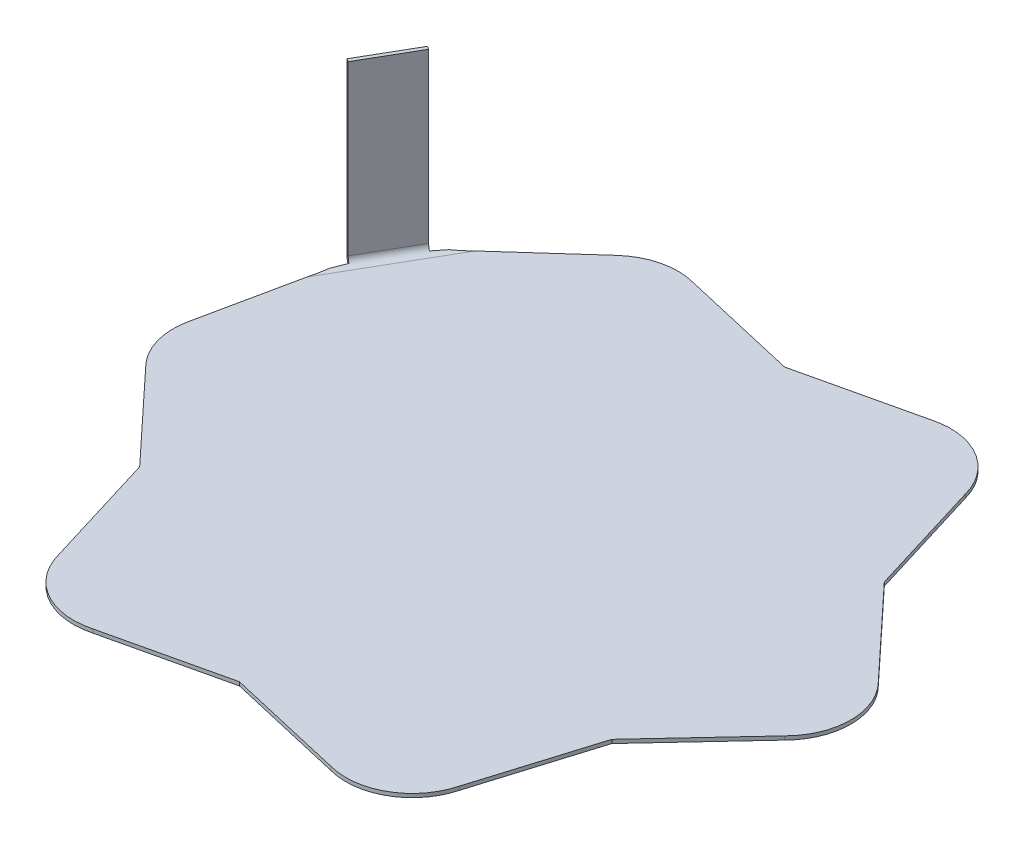
ISO-10303-21;
HEADER;
FILE_DESCRIPTION(('STEP AP214'),'2;1');
FILE_NAME('part.step','',(''),(''),'','','');
FILE_SCHEMA(('AUTOMOTIVE_DESIGN { 1 0 10303 214 1 1 1 1 }'));
ENDSEC;
DATA;
#1=APPLICATION_CONTEXT('core data for automotive mechanical design processes');
#2=APPLICATION_PROTOCOL_DEFINITION('international standard','automotive_design',2000,#1);
#3=PRODUCT_CONTEXT('',#1,'mechanical');
#4=PRODUCT('Part','Part','',(#3));
#5=PRODUCT_RELATED_PRODUCT_CATEGORY('part','',(#4));
#6=PRODUCT_DEFINITION_FORMATION('','',#4);
#7=PRODUCT_DEFINITION_CONTEXT('part definition',#1,'design');
#8=PRODUCT_DEFINITION('design','',#6,#7);
#9=PRODUCT_DEFINITION_SHAPE('','',#8);
#10=(LENGTH_UNIT() NAMED_UNIT(*) SI_UNIT(.MILLI.,.METRE.));
#11=(NAMED_UNIT(*) PLANE_ANGLE_UNIT() SI_UNIT($,.RADIAN.));
#12=(NAMED_UNIT(*) SI_UNIT($,.STERADIAN.) SOLID_ANGLE_UNIT());
#13=UNCERTAINTY_MEASURE_WITH_UNIT(LENGTH_MEASURE(1.E-05),#10,'distance_accuracy_value','');
#14=(GEOMETRIC_REPRESENTATION_CONTEXT(3) GLOBAL_UNCERTAINTY_ASSIGNED_CONTEXT((#13)) GLOBAL_UNIT_ASSIGNED_CONTEXT((#10,
#11,#12)) REPRESENTATION_CONTEXT('',''));
#15=CARTESIAN_POINT('',(0.,0.,0.));
#16=DIRECTION('',(0.,0.,1.));
#17=DIRECTION('',(1.,0.,0.));
#18=AXIS2_PLACEMENT_3D('',#15,#16,#17);
#19=CARTESIAN_POINT('',(-20.0596411839306,-22.644626179026,-11.5814392373897));
#20=DIRECTION('',(0.866025403784438,0.,0.500000000000002));
#21=DIRECTION('',(-0.433012701892222,-0.500000000000002,0.749999999999997));
#22=AXIS2_PLACEMENT_3D('',#19,#20,#21);
#23=PLANE('',#22);
#24=DIRECTION('',(0.,1.,0.));
#25=VECTOR('',#24,1.);
#26=CARTESIAN_POINT('',(-19.0596411839306,-22.644626179026,-13.3134900449586));
#27=LINE('',#26,#25);
#28=CARTESIAN_POINT('',(-19.0596411839305,0.749999999999993,-13.3134900449585));
#29=VERTEX_POINT('',#28);
#30=CARTESIAN_POINT('',(-19.0596411839305,12.163487864756,-13.3134900449585));
#31=VERTEX_POINT('',#30);
#32=EDGE_CURVE('E144',#29,#31,#27,.T.);
#33=ORIENTED_EDGE('',*,*,#32,.F.);
#34=DIRECTION('',(-0.500000000000002,0.,0.866025403784438));
#35=VECTOR('',#34,1.);
#36=CARTESIAN_POINT('',(-20.0596411839305,0.750000000000011,-11.5814392373897));
#37=LINE('',#36,#35);
#38=CARTESIAN_POINT('',(-21.0596411839305,0.750000000000018,-9.84938842982074));
#39=VERTEX_POINT('',#38);
#40=EDGE_CURVE('E686',#29,#39,#37,.T.);
#41=ORIENTED_EDGE('',*,*,#40,.T.);
#42=DIRECTION('',(0.,-1.,0.));
#43=VECTOR('',#42,1.);
#44=CARTESIAN_POINT('',(-21.0596411839306,-22.644626179026,-9.84938842982081));
#45=LINE('',#44,#43);
#46=CARTESIAN_POINT('',(-21.0596411839305,12.163487864756,-9.84938842982071));
#47=VERTEX_POINT('',#46);
#48=EDGE_CURVE('E362',#47,#39,#45,.T.);
#49=ORIENTED_EDGE('',*,*,#48,.F.);
#50=DIRECTION('',(-0.500000000000002,0.,0.866025403784438));
#51=VECTOR('',#50,1.);
#52=CARTESIAN_POINT('',(-20.0596411839305,12.163487864756,-11.5814392373896));
#53=LINE('',#52,#51);
#54=EDGE_CURVE('E365',#31,#47,#53,.T.);
#55=ORIENTED_EDGE('',*,*,#54,.F.);
#56=EDGE_LOOP('',(#33,#41,#49,#55));
#57=FACE_BOUND('',#56,.T.);
#58=ADVANCED_FACE('F140',(#57),#23,.F.);
#59=CARTESIAN_POINT('',(-21.0596411839306,-22.644626179026,-9.84938842982081));
#60=DIRECTION('',(-0.500000000000002,0.,0.866025403784438));
#61=DIRECTION('',(0.,-1.,0.));
#62=AXIS2_PLACEMENT_3D('',#59,#60,#61);
#63=PLANE('',#62);
#64=DIRECTION('',(-0.866025403784438,0.,-0.500000000000002));
#65=VECTOR('',#64,1.);
#66=CARTESIAN_POINT('',(-21.0596411839305,0.750000000000018,-9.84938842982074));
#67=LINE('',#66,#65);
#68=CARTESIAN_POINT('',(-20.8431348329844,0.750000000000001,-9.72438842982075));
#69=VERTEX_POINT('',#68);
#70=EDGE_CURVE('E12',#69,#39,#67,.T.);
#71=ORIENTED_EDGE('',*,*,#70,.F.);
#72=DIRECTION('',(0.,-1.,0.));
#73=VECTOR('',#72,1.);
#74=CARTESIAN_POINT('',(-20.8431348329845,-22.644626179026,-9.72438842982081));
#75=LINE('',#74,#73);
#76=CARTESIAN_POINT('',(-20.8431348329844,12.163487864756,-9.72438842982071));
#77=VERTEX_POINT('',#76);
#78=EDGE_CURVE('E354',#77,#69,#75,.T.);
#79=ORIENTED_EDGE('',*,*,#78,.F.);
#80=DIRECTION('',(-0.866025403784438,0.,-0.500000000000002));
#81=VECTOR('',#80,1.);
#82=CARTESIAN_POINT('',(-21.0596411839305,12.163487864756,-9.84938842982071));
#83=LINE('',#82,#81);
#84=EDGE_CURVE('E178',#77,#47,#83,.T.);
#85=ORIENTED_EDGE('',*,*,#84,.T.);
#86=ORIENTED_EDGE('',*,*,#48,.T.);
#87=EDGE_LOOP('',(#71,#79,#85,#86));
#88=FACE_BOUND('',#87,.T.);
#89=ADVANCED_FACE('F142',(#88),#63,.T.);
#90=CARTESIAN_POINT('',(-20.0596411839305,12.163487864756,-11.5814392373896));
#91=DIRECTION('',(0.,1.,0.));
#92=DIRECTION('',(-0.500000000000002,0.,0.866025403784438));
#93=AXIS2_PLACEMENT_3D('',#90,#91,#92);
#94=PLANE('',#93);
#95=ORIENTED_EDGE('',*,*,#84,.F.);
#96=DIRECTION('',(-0.500000000000002,0.,0.866025403784438));
#97=VECTOR('',#96,1.);
#98=CARTESIAN_POINT('',(-19.8431348329844,12.163487864756,-11.4564392373896));
#99=LINE('',#98,#97);
#100=CARTESIAN_POINT('',(-18.8431348329844,12.163487864756,-13.1884900449585));
#101=VERTEX_POINT('',#100);
#102=EDGE_CURVE('E356',#101,#77,#99,.T.);
#103=ORIENTED_EDGE('',*,*,#102,.F.);
#104=DIRECTION('',(-0.866025403784438,0.,-0.500000000000002));
#105=VECTOR('',#104,1.);
#106=CARTESIAN_POINT('',(-19.0596411839305,12.163487864756,-13.3134900449585));
#107=LINE('',#106,#105);
#108=EDGE_CURVE('E367',#101,#31,#107,.T.);
#109=ORIENTED_EDGE('',*,*,#108,.T.);
#110=ORIENTED_EDGE('',*,*,#54,.T.);
#111=EDGE_LOOP('',(#95,#103,#109,#110));
#112=FACE_BOUND('',#111,.T.);
#113=ADVANCED_FACE('F399',(#112),#94,.T.);
#114=CARTESIAN_POINT('',(-19.0596411839306,-22.644626179026,-13.3134900449586));
#115=DIRECTION('',(0.500000000000002,0.,-0.866025403784438));
#116=DIRECTION('',(0.,1.,0.));
#117=AXIS2_PLACEMENT_3D('',#114,#115,#116);
#118=PLANE('',#117);
#119=DIRECTION('',(0.866025403784438,0.,0.500000000000002));
#120=VECTOR('',#119,1.);
#121=CARTESIAN_POINT('',(-19.0596411839305,0.750000000000004,-13.3134900449585));
#122=LINE('',#121,#120);
#123=CARTESIAN_POINT('',(-18.8431348329844,0.750000000000001,-13.1884900449585));
#124=VERTEX_POINT('',#123);
#125=EDGE_CURVE('E343',#29,#124,#122,.T.);
#126=ORIENTED_EDGE('',*,*,#125,.F.);
#127=ORIENTED_EDGE('',*,*,#32,.T.);
#128=ORIENTED_EDGE('',*,*,#108,.F.);
#129=DIRECTION('',(0.,1.,0.));
#130=VECTOR('',#129,1.);
#131=CARTESIAN_POINT('',(-18.8431348329845,-22.644626179026,-13.1884900449586));
#132=LINE('',#131,#130);
#133=EDGE_CURVE('E358',#124,#101,#132,.T.);
#134=ORIENTED_EDGE('',*,*,#133,.F.);
#135=EDGE_LOOP('',(#126,#127,#128,#134));
#136=FACE_BOUND('',#135,.T.);
#137=ADVANCED_FACE('F402',(#136),#118,.T.);
#138=CARTESIAN_POINT('',(-19.8431348329845,-22.644626179026,-11.4564392373897));
#139=DIRECTION('',(0.866025403784438,0.,0.500000000000002));
#140=DIRECTION('',(-0.433012701892222,-0.500000000000002,0.749999999999997));
#141=AXIS2_PLACEMENT_3D('',#138,#139,#140);
#142=PLANE('',#141);
#143=DIRECTION('',(-0.500000000000002,0.,0.866025403784438));
#144=VECTOR('',#143,1.);
#145=CARTESIAN_POINT('',(-19.8431348329844,0.750000000000011,-11.4564392373897));
#146=LINE('',#145,#144);
#147=EDGE_CURVE('E149',#124,#69,#146,.T.);
#148=ORIENTED_EDGE('',*,*,#147,.F.);
#149=ORIENTED_EDGE('',*,*,#133,.T.);
#150=ORIENTED_EDGE('',*,*,#102,.T.);
#151=ORIENTED_EDGE('',*,*,#78,.T.);
#152=EDGE_LOOP('',(#148,#149,#150,#151));
#153=FACE_BOUND('',#152,.T.);
#154=ADVANCED_FACE('F355',(#153),#142,.T.);
#155=CARTESIAN_POINT('',(-18.5,0.,0.));
#156=DIRECTION('',(0.,1.,0.));
#157=DIRECTION('',(0.,0.,1.));
#158=AXIS2_PLACEMENT_3D('',#155,#156,#157);
#159=CYLINDRICAL_SURFACE('',#158,4.5);
#160=DIRECTION('',(0.,-1.,0.));
#161=VECTOR('',#160,1.);
#162=CARTESIAN_POINT('',(-21.6819805153395,0.,3.18198051533948));
#163=LINE('',#162,#161);
#164=CARTESIAN_POINT('',(-21.6819805153394,0.25,3.18198051533955));
#165=VERTEX_POINT('',#164);
#166=CARTESIAN_POINT('',(-21.6819805153395,0.,3.18198051533948));
#167=VERTEX_POINT('',#166);
#168=EDGE_CURVE('E586',#165,#167,#163,.T.);
#169=ORIENTED_EDGE('',*,*,#168,.F.);
#170=CARTESIAN_POINT('',(-18.5,0.25,0.));
#171=DIRECTION('',(0.,1.,0.));
#172=DIRECTION('',(0.,0.,1.));
#173=AXIS2_PLACEMENT_3D('',#170,#171,#172);
#174=CIRCLE('',#173,4.5);
#175=CARTESIAN_POINT('',(-22.903077106198,0.25,-0.928930566229353));
#176=VERTEX_POINT('',#175);
#177=EDGE_CURVE('E671',#176,#165,#174,.T.);
#178=ORIENTED_EDGE('',*,*,#177,.F.);
#179=DIRECTION('',(0.,-1.,0.));
#180=VECTOR('',#179,1.);
#181=CARTESIAN_POINT('',(-22.903077106198,0.,-0.928930566229353));
#182=LINE('',#181,#180);
#183=CARTESIAN_POINT('',(-22.903077106198,0.,-0.928930566229353));
#184=VERTEX_POINT('',#183);
#185=EDGE_CURVE('E501',#176,#184,#182,.T.);
#186=ORIENTED_EDGE('',*,*,#185,.T.);
#187=CARTESIAN_POINT('',(-18.5,0.,0.));
#188=DIRECTION('',(0.,1.,0.));
#189=DIRECTION('',(0.,0.,1.));
#190=AXIS2_PLACEMENT_3D('',#187,#188,#189);
#191=CIRCLE('',#190,4.5);
#192=EDGE_CURVE('E591',#184,#167,#191,.T.);
#193=ORIENTED_EDGE('',*,*,#192,.T.);
#194=EDGE_LOOP('',(#169,#178,#186,#193));
#195=FACE_BOUND('',#194,.T.);
#196=ADVANCED_FACE('F407',(#195),#159,.T.);
#197=CARTESIAN_POINT('',(-13.1805779992319,0.,12.2954121928525));
#198=DIRECTION('',(0.731234028699535,0.,-0.682126670987029));
#199=DIRECTION('',(-0.682126670987029,0.,-0.731234028699535));
#200=AXIS2_PLACEMENT_3D('',#197,#198,#199);
#201=PLANE('',#200);
#202=DIRECTION('',(0.,-1.,0.));
#203=VECTOR('',#202,1.);
#204=CARTESIAN_POINT('',(-16.0214699700121,0.,9.25000000000001));
#205=LINE('',#204,#203);
#206=CARTESIAN_POINT('',(-16.0214699700121,0.25,9.25000000000001));
#207=VERTEX_POINT('',#206);
#208=CARTESIAN_POINT('',(-16.0214699700121,0.,9.25000000000001));
#209=VERTEX_POINT('',#208);
#210=EDGE_CURVE('E581',#207,#209,#205,.T.);
#211=ORIENTED_EDGE('',*,*,#210,.F.);
#212=DIRECTION('',(-0.682126670987029,0.,-0.731234028699535));
#213=VECTOR('',#212,1.);
#214=CARTESIAN_POINT('',(-13.1805779992319,0.25,12.2954121928525));
#215=LINE('',#214,#213);
#216=EDGE_CURVE('E588',#207,#165,#215,.T.);
#217=ORIENTED_EDGE('',*,*,#216,.T.);
#218=ORIENTED_EDGE('',*,*,#168,.T.);
#219=DIRECTION('',(-0.682126670987029,0.,-0.731234028699535));
#220=VECTOR('',#219,1.);
#221=CARTESIAN_POINT('',(-13.1805779992319,0.,12.2954121928525));
#222=LINE('',#221,#220);
#223=EDGE_CURVE('E606',#209,#167,#222,.T.);
#224=ORIENTED_EDGE('',*,*,#223,.F.);
#225=EDGE_LOOP('',(#211,#217,#218,#224));
#226=FACE_BOUND('',#225,.T.);
#227=ADVANCED_FACE('F411',(#226),#201,.F.);
#228=CARTESIAN_POINT('',(-17.2384283086272,0.,5.26700928747052));
#229=DIRECTION('',(0.95635604002345,0.,-0.292203909471906));
#230=DIRECTION('',(-0.292203909471906,0.,-0.95635604002345));
#231=AXIS2_PLACEMENT_3D('',#228,#229,#230);
#232=PLANE('',#231);
#233=DIRECTION('',(0.,-1.,0.));
#234=VECTOR('',#233,1.);
#235=CARTESIAN_POINT('',(-13.596666218301,0.,17.1861556729733));
#236=LINE('',#235,#234);
#237=CARTESIAN_POINT('',(-13.5966662183011,0.25,17.1861556729731));
#238=VERTEX_POINT('',#237);
#239=CARTESIAN_POINT('',(-13.596666218301,0.,17.1861556729733));
#240=VERTEX_POINT('',#239);
#241=EDGE_CURVE('E579',#238,#240,#236,.T.);
#242=ORIENTED_EDGE('',*,*,#241,.F.);
#243=DIRECTION('',(-0.292203909471906,0.,-0.95635604002345));
#244=VECTOR('',#243,1.);
#245=CARTESIAN_POINT('',(-17.2384283086272,0.25,5.26700928747052));
#246=LINE('',#245,#244);
#247=EDGE_CURVE('E583',#238,#207,#246,.T.);
#248=ORIENTED_EDGE('',*,*,#247,.T.);
#249=ORIENTED_EDGE('',*,*,#210,.T.);
#250=DIRECTION('',(-0.292203909471906,0.,-0.95635604002345));
#251=VECTOR('',#250,1.);
#252=CARTESIAN_POINT('',(-17.2384283086272,0.,5.26700928747052));
#253=LINE('',#252,#251);
#254=EDGE_CURVE('E608',#240,#209,#253,.T.);
#255=ORIENTED_EDGE('',*,*,#254,.F.);
#256=EDGE_LOOP('',(#242,#248,#249,#255));
#257=FACE_BOUND('',#256,.T.);
#258=ADVANCED_FACE('F417',(#257),#232,.F.);
#259=CARTESIAN_POINT('',(-9.25000000000018,0.,16.021469970012));
#260=DIRECTION('',(0.,1.,0.));
#261=DIRECTION('',(0.,0.,1.));
#262=AXIS2_PLACEMENT_3D('',#259,#260,#261);
#263=CYLINDRICAL_SURFACE('',#262,4.5);
#264=DIRECTION('',(0.,-1.,0.));
#265=VECTOR('',#264,1.);
#266=CARTESIAN_POINT('',(-8.08531429703886,0.,20.3681361883128));
#267=LINE('',#266,#265);
#268=CARTESIAN_POINT('',(-8.08531429703882,0.25,20.3681361883128));
#269=VERTEX_POINT('',#268);
#270=CARTESIAN_POINT('',(-8.08531429703886,0.,20.3681361883128));
#271=VERTEX_POINT('',#270);
#272=EDGE_CURVE('E571',#269,#271,#267,.T.);
#273=ORIENTED_EDGE('',*,*,#272,.F.);
#274=CARTESIAN_POINT('',(-9.25000000000018,0.25,16.021469970012));
#275=DIRECTION('',(0.,1.,0.));
#276=DIRECTION('',(0.,0.,1.));
#277=AXIS2_PLACEMENT_3D('',#274,#275,#276);
#278=CIRCLE('',#277,4.5);
#279=EDGE_CURVE('E664',#238,#269,#278,.T.);
#280=ORIENTED_EDGE('',*,*,#279,.F.);
#281=ORIENTED_EDGE('',*,*,#241,.T.);
#282=CARTESIAN_POINT('',(-9.25000000000018,0.,16.021469970012));
#283=DIRECTION('',(0.,1.,0.));
#284=DIRECTION('',(0.,0.,1.));
#285=AXIS2_PLACEMENT_3D('',#282,#283,#284);
#286=CIRCLE('',#285,4.5);
#287=EDGE_CURVE('E576',#240,#271,#286,.T.);
#288=ORIENTED_EDGE('',*,*,#287,.T.);
#289=EDGE_LOOP('',(#273,#280,#281,#288));
#290=FACE_BOUND('',#289,.T.);
#291=ADVANCED_FACE('F426',(#290),#263,.T.);
#292=CARTESIAN_POINT('',(4.05785030939505,0.,17.5624214803234));
#293=DIRECTION('',(-0.225122011323897,0.,-0.974330580458954));
#294=DIRECTION('',(-0.974330580458955,0.,0.225122011323898));
#295=AXIS2_PLACEMENT_3D('',#292,#293,#294);
#296=PLANE('',#295);
#297=DIRECTION('',(0.,-1.,0.));
#298=VECTOR('',#297,1.);
#299=CARTESIAN_POINT('',(-1.73472347597681E-13,0.,18.5));
#300=LINE('',#299,#298);
#301=CARTESIAN_POINT('',(-1.73472347597681E-13,0.25,18.5));
#302=VERTEX_POINT('',#301);
#303=CARTESIAN_POINT('',(-1.73472347597681E-13,0.,18.5));
#304=VERTEX_POINT('',#303);
#305=EDGE_CURVE('E566',#302,#304,#300,.T.);
#306=ORIENTED_EDGE('',*,*,#305,.F.);
#307=DIRECTION('',(-0.974330580458955,0.,0.225122011323898));
#308=VECTOR('',#307,1.);
#309=CARTESIAN_POINT('',(4.05785030939505,0.25,17.5624214803234));
#310=LINE('',#309,#308);
#311=EDGE_CURVE('E573',#302,#269,#310,.T.);
#312=ORIENTED_EDGE('',*,*,#311,.T.);
#313=ORIENTED_EDGE('',*,*,#272,.T.);
#314=DIRECTION('',(-0.974330580458955,0.,0.225122011323898));
#315=VECTOR('',#314,1.);
#316=CARTESIAN_POINT('',(4.05785030939505,0.,17.5624214803234));
#317=LINE('',#316,#315);
#318=EDGE_CURVE('E613',#304,#271,#317,.T.);
#319=ORIENTED_EDGE('',*,*,#318,.F.);
#320=EDGE_LOOP('',(#306,#312,#313,#319));
#321=FACE_BOUND('',#320,.T.);
#322=ADVANCED_FACE('F430',(#321),#296,.F.);
#323=CARTESIAN_POINT('',(-4.05785030939542,0.,17.5624214803233));
#324=DIRECTION('',(0.225122011323919,0.,-0.974330580458949));
#325=DIRECTION('',(-0.974330580458949,0.,-0.225122011323919));
#326=AXIS2_PLACEMENT_3D('',#323,#324,#325);
#327=PLANE('',#326);
#328=DIRECTION('',(0.,-1.,0.));
#329=VECTOR('',#328,1.);
#330=CARTESIAN_POINT('',(8.08531429703849,0.,20.368136188313));
#331=LINE('',#330,#329);
#332=CARTESIAN_POINT('',(8.08531429703843,0.25,20.368136188313));
#333=VERTEX_POINT('',#332);
#334=CARTESIAN_POINT('',(8.08531429703849,0.,20.368136188313));
#335=VERTEX_POINT('',#334);
#336=EDGE_CURVE('E564',#333,#335,#331,.T.);
#337=ORIENTED_EDGE('',*,*,#336,.F.);
#338=DIRECTION('',(-0.974330580458949,0.,-0.225122011323919));
#339=VECTOR('',#338,1.);
#340=CARTESIAN_POINT('',(-4.05785030939542,0.25,17.5624214803233));
#341=LINE('',#340,#339);
#342=EDGE_CURVE('E568',#333,#302,#341,.T.);
#343=ORIENTED_EDGE('',*,*,#342,.T.);
#344=ORIENTED_EDGE('',*,*,#305,.T.);
#345=DIRECTION('',(-0.974330580458949,0.,-0.225122011323919));
#346=VECTOR('',#345,1.);
#347=CARTESIAN_POINT('',(-4.05785030939542,0.,17.5624214803233));
#348=LINE('',#347,#346);
#349=EDGE_CURVE('E619',#335,#304,#348,.T.);
#350=ORIENTED_EDGE('',*,*,#349,.F.);
#351=EDGE_LOOP('',(#337,#343,#344,#350));
#352=FACE_BOUND('',#351,.T.);
#353=ADVANCED_FACE('F434',(#352),#327,.F.);
#354=CARTESIAN_POINT('',(9.24999999999985,0.,16.0214699700122));
#355=DIRECTION('',(0.,1.,0.));
#356=DIRECTION('',(0.,0.,1.));
#357=AXIS2_PLACEMENT_3D('',#354,#355,#356);
#358=CYLINDRICAL_SURFACE('',#357,4.5);
#359=DIRECTION('',(0.,-1.,0.));
#360=VECTOR('',#359,1.);
#361=CARTESIAN_POINT('',(13.5966662183007,0.,17.1861556729736));
#362=LINE('',#361,#360);
#363=CARTESIAN_POINT('',(13.5966662183007,0.25,17.1861556729735));
#364=VERTEX_POINT('',#363);
#365=CARTESIAN_POINT('',(13.5966662183007,0.,17.1861556729736));
#366=VERTEX_POINT('',#365);
#367=EDGE_CURVE('E556',#364,#366,#362,.T.);
#368=ORIENTED_EDGE('',*,*,#367,.F.);
#369=CARTESIAN_POINT('',(9.24999999999985,0.25,16.0214699700122));
#370=DIRECTION('',(0.,1.,0.));
#371=DIRECTION('',(0.,0.,1.));
#372=AXIS2_PLACEMENT_3D('',#369,#370,#371);
#373=CIRCLE('',#372,4.5);
#374=EDGE_CURVE('E656',#333,#364,#373,.T.);
#375=ORIENTED_EDGE('',*,*,#374,.F.);
#376=ORIENTED_EDGE('',*,*,#336,.T.);
#377=CARTESIAN_POINT('',(9.24999999999985,0.,16.0214699700122));
#378=DIRECTION('',(0.,1.,0.));
#379=DIRECTION('',(0.,0.,1.));
#380=AXIS2_PLACEMENT_3D('',#377,#378,#379);
#381=CIRCLE('',#380,4.5);
#382=EDGE_CURVE('E561',#335,#366,#381,.T.);
#383=ORIENTED_EDGE('',*,*,#382,.T.);
#384=EDGE_LOOP('',(#368,#375,#376,#383));
#385=FACE_BOUND('',#384,.T.);
#386=ADVANCED_FACE('F438',(#385),#358,.T.);
#387=CARTESIAN_POINT('',(17.2384283086271,0.,5.26700928747103));
#388=DIRECTION('',(-0.956356040023441,0.,-0.292203909471933));
#389=DIRECTION('',(-0.292203909471933,0.,0.956356040023441));
#390=AXIS2_PLACEMENT_3D('',#387,#388,#389);
#391=PLANE('',#390);
#392=DIRECTION('',(0.,-1.,0.));
#393=VECTOR('',#392,1.);
#394=CARTESIAN_POINT('',(16.0214699700121,0.,9.25000000000011));
#395=LINE('',#394,#393);
#396=CARTESIAN_POINT('',(16.0214699700121,0.25,9.25000000000011));
#397=VERTEX_POINT('',#396);
#398=CARTESIAN_POINT('',(16.0214699700121,0.,9.25000000000011));
#399=VERTEX_POINT('',#398);
#400=EDGE_CURVE('E551',#397,#399,#395,.T.);
#401=ORIENTED_EDGE('',*,*,#400,.F.);
#402=DIRECTION('',(-0.292203909471933,0.,0.956356040023441));
#403=VECTOR('',#402,1.);
#404=CARTESIAN_POINT('',(17.2384283086271,0.25,5.26700928747103));
#405=LINE('',#404,#403);
#406=EDGE_CURVE('E558',#397,#364,#405,.T.);
#407=ORIENTED_EDGE('',*,*,#406,.T.);
#408=ORIENTED_EDGE('',*,*,#367,.T.);
#409=DIRECTION('',(-0.292203909471933,0.,0.956356040023441));
#410=VECTOR('',#409,1.);
#411=CARTESIAN_POINT('',(17.2384283086271,0.,5.26700928747103));
#412=LINE('',#411,#410);
#413=EDGE_CURVE('E622',#399,#366,#412,.T.);
#414=ORIENTED_EDGE('',*,*,#413,.F.);
#415=EDGE_LOOP('',(#401,#407,#408,#414));
#416=FACE_BOUND('',#415,.T.);
#417=ADVANCED_FACE('F442',(#416),#391,.F.);
#418=CARTESIAN_POINT('',(13.1805779992318,0.,12.2954121928526));
#419=DIRECTION('',(-0.731234028699531,0.,-0.682126670987035));
#420=DIRECTION('',(-0.682126670987035,0.,0.731234028699531));
#421=AXIS2_PLACEMENT_3D('',#418,#419,#420);
#422=PLANE('',#421);
#423=DIRECTION('',(0.,-1.,0.));
#424=VECTOR('',#423,1.);
#425=CARTESIAN_POINT('',(21.6819805153395,0.,3.1819805153396));
#426=LINE('',#425,#424);
#427=CARTESIAN_POINT('',(21.6819805153395,0.25,3.18198051533959));
#428=VERTEX_POINT('',#427);
#429=CARTESIAN_POINT('',(21.6819805153395,0.,3.1819805153396));
#430=VERTEX_POINT('',#429);
#431=EDGE_CURVE('E549',#428,#430,#426,.T.);
#432=ORIENTED_EDGE('',*,*,#431,.F.);
#433=DIRECTION('',(-0.682126670987035,0.,0.731234028699531));
#434=VECTOR('',#433,1.);
#435=CARTESIAN_POINT('',(13.1805779992318,0.25,12.2954121928526));
#436=LINE('',#435,#434);
#437=EDGE_CURVE('E553',#428,#397,#436,.T.);
#438=ORIENTED_EDGE('',*,*,#437,.T.);
#439=ORIENTED_EDGE('',*,*,#400,.T.);
#440=DIRECTION('',(-0.682126670987035,0.,0.731234028699531));
#441=VECTOR('',#440,1.);
#442=CARTESIAN_POINT('',(13.1805779992318,0.,12.2954121928526));
#443=LINE('',#442,#441);
#444=EDGE_CURVE('E625',#430,#399,#443,.T.);
#445=ORIENTED_EDGE('',*,*,#444,.F.);
#446=EDGE_LOOP('',(#432,#438,#439,#445));
#447=FACE_BOUND('',#446,.T.);
#448=ADVANCED_FACE('F446',(#447),#422,.F.);
#449=CARTESIAN_POINT('',(18.5,0.,1.29184809537196E-13));
#450=DIRECTION('',(0.,1.,0.));
#451=DIRECTION('',(0.,0.,1.));
#452=AXIS2_PLACEMENT_3D('',#449,#450,#451);
#453=CYLINDRICAL_SURFACE('',#452,4.5);
#454=DIRECTION('',(0.,-1.,0.));
#455=VECTOR('',#454,1.);
#456=CARTESIAN_POINT('',(21.6819805153395,0.,-3.18198051533933));
#457=LINE('',#456,#455);
#458=CARTESIAN_POINT('',(21.6819805153394,0.25,-3.18198051533943));
#459=VERTEX_POINT('',#458);
#460=CARTESIAN_POINT('',(21.6819805153395,0.,-3.18198051533933));
#461=VERTEX_POINT('',#460);
#462=EDGE_CURVE('E541',#459,#461,#457,.T.);
#463=ORIENTED_EDGE('',*,*,#462,.F.);
#464=CARTESIAN_POINT('',(18.5,0.25,1.29184809537196E-13));
#465=DIRECTION('',(0.,1.,0.));
#466=DIRECTION('',(0.,0.,1.));
#467=AXIS2_PLACEMENT_3D('',#464,#465,#466);
#468=CIRCLE('',#467,4.5);
#469=EDGE_CURVE('E648',#428,#459,#468,.T.);
#470=ORIENTED_EDGE('',*,*,#469,.F.);
#471=ORIENTED_EDGE('',*,*,#431,.T.);
#472=CARTESIAN_POINT('',(18.5,0.,1.29184809537196E-13));
#473=DIRECTION('',(0.,1.,0.));
#474=DIRECTION('',(0.,0.,1.));
#475=AXIS2_PLACEMENT_3D('',#472,#473,#474);
#476=CIRCLE('',#475,4.5);
#477=EDGE_CURVE('E546',#430,#461,#476,.T.);
#478=ORIENTED_EDGE('',*,*,#477,.T.);
#479=EDGE_LOOP('',(#463,#470,#471,#478));
#480=FACE_BOUND('',#479,.T.);
#481=ADVANCED_FACE('F450',(#480),#453,.T.);
#482=CARTESIAN_POINT('',(13.180577999232,0.,-12.2954121928524));
#483=DIRECTION('',(-0.731234028699541,0.,0.682126670987024));
#484=DIRECTION('',(0.682126670987024,0.,0.731234028699541));
#485=AXIS2_PLACEMENT_3D('',#482,#483,#484);
#486=PLANE('',#485);
#487=DIRECTION('',(0.,-1.,0.));
#488=VECTOR('',#487,1.);
#489=CARTESIAN_POINT('',(16.0214699700122,0.,-9.24999999999993));
#490=LINE('',#489,#488);
#491=CARTESIAN_POINT('',(16.0214699700122,0.25,-9.24999999999993));
#492=VERTEX_POINT('',#491);
#493=CARTESIAN_POINT('',(16.0214699700122,0.,-9.24999999999993));
#494=VERTEX_POINT('',#493);
#495=EDGE_CURVE('E536',#492,#494,#490,.T.);
#496=ORIENTED_EDGE('',*,*,#495,.F.);
#497=DIRECTION('',(0.682126670987024,0.,0.731234028699541));
#498=VECTOR('',#497,1.);
#499=CARTESIAN_POINT('',(13.180577999232,0.25,-12.2954121928524));
#500=LINE('',#499,#498);
#501=EDGE_CURVE('E543',#492,#459,#500,.T.);
#502=ORIENTED_EDGE('',*,*,#501,.T.);
#503=ORIENTED_EDGE('',*,*,#462,.T.);
#504=DIRECTION('',(0.682126670987024,0.,0.731234028699541));
#505=VECTOR('',#504,1.);
#506=CARTESIAN_POINT('',(13.180577999232,0.,-12.2954121928524));
#507=LINE('',#506,#505);
#508=EDGE_CURVE('E628',#494,#461,#507,.T.);
#509=ORIENTED_EDGE('',*,*,#508,.F.);
#510=EDGE_LOOP('',(#496,#502,#503,#509));
#511=FACE_BOUND('',#510,.T.);
#512=ADVANCED_FACE('F454',(#511),#486,.F.);
#513=CARTESIAN_POINT('',(17.2384283086272,0.,-5.26700928747075));
#514=DIRECTION('',(-0.956356040023446,0.,0.292203909471918));
#515=DIRECTION('',(0.292203909471918,0.,0.956356040023446));
#516=AXIS2_PLACEMENT_3D('',#513,#514,#515);
#517=PLANE('',#516);
#518=DIRECTION('',(0.,-1.,0.));
#519=VECTOR('',#518,1.);
#520=CARTESIAN_POINT('',(13.5966662183009,0.,-17.1861556729734));
#521=LINE('',#520,#519);
#522=CARTESIAN_POINT('',(13.5966662183009,0.25,-17.1861556729733));
#523=VERTEX_POINT('',#522);
#524=CARTESIAN_POINT('',(13.5966662183009,0.,-17.1861556729734));
#525=VERTEX_POINT('',#524);
#526=EDGE_CURVE('E534',#523,#525,#521,.T.);
#527=ORIENTED_EDGE('',*,*,#526,.F.);
#528=DIRECTION('',(0.292203909471918,0.,0.956356040023446));
#529=VECTOR('',#528,1.);
#530=CARTESIAN_POINT('',(17.2384283086272,0.25,-5.26700928747075));
#531=LINE('',#530,#529);
#532=EDGE_CURVE('E538',#523,#492,#531,.T.);
#533=ORIENTED_EDGE('',*,*,#532,.T.);
#534=ORIENTED_EDGE('',*,*,#495,.T.);
#535=DIRECTION('',(0.292203909471918,0.,0.956356040023446));
#536=VECTOR('',#535,1.);
#537=CARTESIAN_POINT('',(17.2384283086272,0.,-5.26700928747075));
#538=LINE('',#537,#536);
#539=EDGE_CURVE('E631',#525,#494,#538,.T.);
#540=ORIENTED_EDGE('',*,*,#539,.F.);
#541=EDGE_LOOP('',(#527,#533,#534,#540));
#542=FACE_BOUND('',#541,.T.);
#543=ADVANCED_FACE('F458',(#542),#517,.F.);
#544=CARTESIAN_POINT('',(9.25000000000007,0.,-16.0214699700121));
#545=DIRECTION('',(0.,1.,0.));
#546=DIRECTION('',(0.,0.,1.));
#547=AXIS2_PLACEMENT_3D('',#544,#545,#546);
#548=CYLINDRICAL_SURFACE('',#547,4.5);
#549=DIRECTION('',(0.,-1.,0.));
#550=VECTOR('',#549,1.);
#551=CARTESIAN_POINT('',(8.08531429703873,0.,-20.3681361883129));
#552=LINE('',#551,#550);
#553=CARTESIAN_POINT('',(8.08531429703857,0.25,-20.3681361883128));
#554=VERTEX_POINT('',#553);
#555=CARTESIAN_POINT('',(8.08531429703873,0.,-20.3681361883129));
#556=VERTEX_POINT('',#555);
#557=EDGE_CURVE('E526',#554,#556,#552,.T.);
#558=ORIENTED_EDGE('',*,*,#557,.F.);
#559=CARTESIAN_POINT('',(9.25000000000007,0.25,-16.0214699700121));
#560=DIRECTION('',(0.,1.,0.));
#561=DIRECTION('',(0.,0.,1.));
#562=AXIS2_PLACEMENT_3D('',#559,#560,#561);
#563=CIRCLE('',#562,4.5);
#564=EDGE_CURVE('E640',#523,#554,#563,.T.);
#565=ORIENTED_EDGE('',*,*,#564,.F.);
#566=ORIENTED_EDGE('',*,*,#526,.T.);
#567=CARTESIAN_POINT('',(9.25000000000007,0.,-16.0214699700121));
#568=DIRECTION('',(0.,1.,0.));
#569=DIRECTION('',(0.,0.,1.));
#570=AXIS2_PLACEMENT_3D('',#567,#568,#569);
#571=CIRCLE('',#570,4.5);
#572=EDGE_CURVE('E531',#525,#556,#571,.T.);
#573=ORIENTED_EDGE('',*,*,#572,.T.);
#574=EDGE_LOOP('',(#558,#565,#566,#573));
#575=FACE_BOUND('',#574,.T.);
#576=ADVANCED_FACE('F462',(#575),#548,.T.);
#577=CARTESIAN_POINT('',(-4.05785030939517,0.,-17.5624214803234));
#578=DIRECTION('',(0.225122011323904,0.,0.974330580458953));
#579=DIRECTION('',(0.974330580458953,0.,-0.225122011323904));
#580=AXIS2_PLACEMENT_3D('',#577,#578,#579);
#581=PLANE('',#580);
#582=DIRECTION('',(0.,-1.,0.));
#583=VECTOR('',#582,1.);
#584=CARTESIAN_POINT('',(0.,0.,-18.5));
#585=LINE('',#584,#583);
#586=CARTESIAN_POINT('',(0.,0.25,-18.5));
#587=VERTEX_POINT('',#586);
#588=CARTESIAN_POINT('',(0.,0.,-18.5));
#589=VERTEX_POINT('',#588);
#590=EDGE_CURVE('E518',#587,#589,#585,.T.);
#591=ORIENTED_EDGE('',*,*,#590,.F.);
#592=DIRECTION('',(0.974330580458953,0.,-0.225122011323904));
#593=VECTOR('',#592,1.);
#594=CARTESIAN_POINT('',(-4.05785030939517,0.25,-17.5624214803234));
#595=LINE('',#594,#593);
#596=EDGE_CURVE('E528',#587,#554,#595,.T.);
#597=ORIENTED_EDGE('',*,*,#596,.T.);
#598=ORIENTED_EDGE('',*,*,#557,.T.);
#599=DIRECTION('',(0.974330580458953,0.,-0.225122011323904));
#600=VECTOR('',#599,1.);
#601=CARTESIAN_POINT('',(-4.05785030939517,0.,-17.5624214803234));
#602=LINE('',#601,#600);
#603=EDGE_CURVE('E512',#589,#556,#602,.T.);
#604=ORIENTED_EDGE('',*,*,#603,.F.);
#605=EDGE_LOOP('',(#591,#597,#598,#604));
#606=FACE_BOUND('',#605,.T.);
#607=ADVANCED_FACE('F466',(#606),#581,.F.);
#608=CARTESIAN_POINT('',(4.0578503093953,0.,-17.5624214803233));
#609=DIRECTION('',(-0.225122011323912,0.,0.974330580458951));
#610=DIRECTION('',(0.974330580458951,0.,0.225122011323912));
#611=AXIS2_PLACEMENT_3D('',#608,#609,#610);
#612=PLANE('',#611);
#613=DIRECTION('',(0.,-1.,0.));
#614=VECTOR('',#613,1.);
#615=CARTESIAN_POINT('',(-8.08531429703863,0.,-20.3681361883129));
#616=LINE('',#615,#614);
#617=CARTESIAN_POINT('',(-8.08531429703856,0.25,-20.3681361883129));
#618=VERTEX_POINT('',#617);
#619=CARTESIAN_POINT('',(-8.08531429703863,0.,-20.3681361883129));
#620=VERTEX_POINT('',#619);
#621=EDGE_CURVE('E515',#618,#620,#616,.T.);
#622=ORIENTED_EDGE('',*,*,#621,.F.);
#623=DIRECTION('',(0.974330580458951,0.,0.225122011323912));
#624=VECTOR('',#623,1.);
#625=CARTESIAN_POINT('',(4.0578503093953,0.25,-17.5624214803233));
#626=LINE('',#625,#624);
#627=EDGE_CURVE('E523',#618,#587,#626,.T.);
#628=ORIENTED_EDGE('',*,*,#627,.T.);
#629=ORIENTED_EDGE('',*,*,#590,.T.);
#630=DIRECTION('',(0.974330580458951,0.,0.225122011323912));
#631=VECTOR('',#630,1.);
#632=CARTESIAN_POINT('',(4.0578503093953,0.,-17.5624214803233));
#633=LINE('',#632,#631);
#634=EDGE_CURVE('E505',#620,#589,#633,.T.);
#635=ORIENTED_EDGE('',*,*,#634,.F.);
#636=EDGE_LOOP('',(#622,#628,#629,#635));
#637=FACE_BOUND('',#636,.T.);
#638=ADVANCED_FACE('F470',(#637),#612,.F.);
#639=CARTESIAN_POINT('',(-9.24999999999996,0.,-16.0214699700121));
#640=DIRECTION('',(0.,1.,0.));
#641=DIRECTION('',(0.,0.,1.));
#642=AXIS2_PLACEMENT_3D('',#639,#640,#641);
#643=CYLINDRICAL_SURFACE('',#642,4.5);
#644=DIRECTION('',(0.,-1.,0.));
#645=VECTOR('',#644,1.);
#646=CARTESIAN_POINT('',(-12.2560160218055,0.,-19.3701813156866));
#647=LINE('',#646,#645);
#648=CARTESIAN_POINT('',(-12.2560160218055,0.25,-19.3701813156866));
#649=VERTEX_POINT('',#648);
#650=CARTESIAN_POINT('',(-12.2560160218055,0.,-19.3701813156866));
#651=VERTEX_POINT('',#650);
#652=EDGE_CURVE('E598',#649,#651,#647,.T.);
#653=ORIENTED_EDGE('',*,*,#652,.F.);
#654=CARTESIAN_POINT('',(-9.24999999999996,0.25,-16.0214699700121));
#655=DIRECTION('',(0.,1.,0.));
#656=DIRECTION('',(0.,0.,1.));
#657=AXIS2_PLACEMENT_3D('',#654,#655,#656);
#658=CIRCLE('',#657,4.5);
#659=EDGE_CURVE('E371',#618,#649,#658,.T.);
#660=ORIENTED_EDGE('',*,*,#659,.F.);
#661=ORIENTED_EDGE('',*,*,#621,.T.);
#662=CARTESIAN_POINT('',(-9.24999999999996,0.,-16.0214699700121));
#663=DIRECTION('',(0.,1.,0.));
#664=DIRECTION('',(0.,0.,1.));
#665=AXIS2_PLACEMENT_3D('',#662,#663,#664);
#666=CIRCLE('',#665,4.5);
#667=EDGE_CURVE('E506',#620,#651,#666,.T.);
#668=ORIENTED_EDGE('',*,*,#667,.T.);
#669=EDGE_LOOP('',(#653,#660,#661,#668));
#670=FACE_BOUND('',#669,.T.);
#671=ADVANCED_FACE('F474',(#670),#643,.T.);
#672=CARTESIAN_POINT('',(0.,0.,0.));
#673=DIRECTION('',(0.,1.,0.));
#674=DIRECTION('',(0.,0.,1.));
#675=AXIS2_PLACEMENT_3D('',#672,#673,#674);
#676=PLANE('',#675);
#677=DIRECTION('',(-0.500000000000002,0.,0.866025403784438));
#678=VECTOR('',#677,1.);
#679=CARTESIAN_POINT('',(-19.4101221310922,0.,-11.2064392373896));
#680=LINE('',#679,#678);
#681=CARTESIAN_POINT('',(-17.3226478611046,0.,-14.8220507325009));
#682=VERTEX_POINT('',#681);
#683=CARTESIAN_POINT('',(-21.4975964010798,0.,-7.59082774227838));
#684=VERTEX_POINT('',#683);
#685=EDGE_CURVE('E493',#682,#684,#680,.T.);
#686=ORIENTED_EDGE('',*,*,#685,.F.);
#687=DIRECTION('',(0.744158076816546,0.,-0.668003560401215));
#688=VECTOR('',#687,1.);
#689=CARTESIAN_POINT('',(-15.0979086657465,0.,-16.8191179548589));
#690=LINE('',#689,#688);
#691=EDGE_CURVE('E504',#682,#651,#690,.T.);
#692=ORIENTED_EDGE('',*,*,#691,.T.);
#693=ORIENTED_EDGE('',*,*,#667,.F.);
#694=ORIENTED_EDGE('',*,*,#634,.T.);
#695=ORIENTED_EDGE('',*,*,#603,.T.);
#696=ORIENTED_EDGE('',*,*,#572,.F.);
#697=ORIENTED_EDGE('',*,*,#539,.T.);
#698=ORIENTED_EDGE('',*,*,#508,.T.);
#699=ORIENTED_EDGE('',*,*,#477,.F.);
#700=ORIENTED_EDGE('',*,*,#444,.T.);
#701=ORIENTED_EDGE('',*,*,#413,.T.);
#702=ORIENTED_EDGE('',*,*,#382,.F.);
#703=ORIENTED_EDGE('',*,*,#349,.T.);
#704=ORIENTED_EDGE('',*,*,#318,.T.);
#705=ORIENTED_EDGE('',*,*,#287,.F.);
#706=ORIENTED_EDGE('',*,*,#254,.T.);
#707=ORIENTED_EDGE('',*,*,#223,.T.);
#708=ORIENTED_EDGE('',*,*,#192,.F.);
#709=DIRECTION('',(-0.206429014717634,0.,0.978461579155108));
#710=VECTOR('',#709,1.);
#711=CARTESIAN_POINT('',(-22.1147377510281,0.,-4.66561347112427));
#712=LINE('',#711,#710);
#713=EDGE_CURVE('E187',#684,#184,#712,.T.);
#714=ORIENTED_EDGE('',*,*,#713,.F.);
#715=EDGE_LOOP('',(#686,#692,#693,#694,#695,#696,#697,#698,#699,#700,#701,#702,#703,#704,#705,
#706,#707,#708,#714));
#716=FACE_BOUND('',#715,.T.);
#717=ADVANCED_FACE('F478',(#716),#676,.F.);
#718=CARTESIAN_POINT('',(-15.0979086657465,0.,-16.8191179548589));
#719=DIRECTION('',(0.668003560401215,0.,0.744158076816546));
#720=DIRECTION('',(0.744158076816546,0.,-0.668003560401215));
#721=AXIS2_PLACEMENT_3D('',#718,#719,#720);
#722=PLANE('',#721);
#723=ORIENTED_EDGE('',*,*,#691,.F.);
#724=CARTESIAN_POINT('',(-17.3226478611046,0.25,-14.8220507325009));
#725=CARTESIAN_POINT('',(-17.3226478611046,0.,-14.8220507325009));
#726=B_SPLINE_CURVE_WITH_KNOTS('',1,(#724,#725),.UNSPECIFIED.,.F.,.F.,(2,2),(0.,1.),.UNSPECIFIED.);
#727=CARTESIAN_POINT('',(-17.3226478611046,0.25,-14.8220507325009));
#728=VERTEX_POINT('',#727);
#729=EDGE_CURVE('E602',#682,#728,#726,.F.);
#730=ORIENTED_EDGE('',*,*,#729,.T.);
#731=DIRECTION('',(0.744158076816546,0.,-0.668003560401215));
#732=VECTOR('',#731,1.);
#733=CARTESIAN_POINT('',(-15.0979086657465,0.25,-16.8191179548589));
#734=LINE('',#733,#732);
#735=EDGE_CURVE('E601',#728,#649,#734,.T.);
#736=ORIENTED_EDGE('',*,*,#735,.T.);
#737=ORIENTED_EDGE('',*,*,#652,.T.);
#738=EDGE_LOOP('',(#723,#730,#736,#737));
#739=FACE_BOUND('',#738,.T.);
#740=ADVANCED_FACE('F481',(#739),#722,.F.);
#741=CARTESIAN_POINT('',(0.,0.25,0.));
#742=DIRECTION('',(0.,1.,0.));
#743=DIRECTION('',(0.,0.,1.));
#744=AXIS2_PLACEMENT_3D('',#741,#742,#743);
#745=PLANE('',#744);
#746=ORIENTED_EDGE('',*,*,#735,.F.);
#747=DIRECTION('',(-0.500000000000002,0.,0.866025403784438));
#748=VECTOR('',#747,1.);
#749=CARTESIAN_POINT('',(-19.4101221310922,0.25,-11.2064392373896));
#750=LINE('',#749,#748);
#751=CARTESIAN_POINT('',(-21.4975964010798,0.25,-7.59082774227838));
#752=VERTEX_POINT('',#751);
#753=EDGE_CURVE('E595',#728,#752,#750,.T.);
#754=ORIENTED_EDGE('',*,*,#753,.T.);
#755=DIRECTION('',(-0.206429014717634,0.,0.978461579155108));
#756=VECTOR('',#755,1.);
#757=CARTESIAN_POINT('',(-22.1147377510281,0.25,-4.66561347112427));
#758=LINE('',#757,#756);
#759=EDGE_CURVE('E384',#752,#176,#758,.T.);
#760=ORIENTED_EDGE('',*,*,#759,.T.);
#761=ORIENTED_EDGE('',*,*,#177,.T.);
#762=ORIENTED_EDGE('',*,*,#216,.F.);
#763=ORIENTED_EDGE('',*,*,#247,.F.);
#764=ORIENTED_EDGE('',*,*,#279,.T.);
#765=ORIENTED_EDGE('',*,*,#311,.F.);
#766=ORIENTED_EDGE('',*,*,#342,.F.);
#767=ORIENTED_EDGE('',*,*,#374,.T.);
#768=ORIENTED_EDGE('',*,*,#406,.F.);
#769=ORIENTED_EDGE('',*,*,#437,.F.);
#770=ORIENTED_EDGE('',*,*,#469,.T.);
#771=ORIENTED_EDGE('',*,*,#501,.F.);
#772=ORIENTED_EDGE('',*,*,#532,.F.);
#773=ORIENTED_EDGE('',*,*,#564,.T.);
#774=ORIENTED_EDGE('',*,*,#596,.F.);
#775=ORIENTED_EDGE('',*,*,#627,.F.);
#776=ORIENTED_EDGE('',*,*,#659,.T.);
#777=EDGE_LOOP('',(#746,#754,#760,#761,#762,#763,#764,#765,#766,#767,#768,#769,#770,#771,#772,
#773,#774,#775,#776));
#778=FACE_BOUND('',#777,.T.);
#779=ADVANCED_FACE('F397',(#778),#745,.T.);
#780=CARTESIAN_POINT('',(-22.1147377510281,0.,-4.66561347112427));
#781=DIRECTION('',(-0.978461579155108,0.,-0.206429014717634));
#782=DIRECTION('',(-0.206429014717634,0.,0.978461579155108));
#783=AXIS2_PLACEMENT_3D('',#780,#781,#782);
#784=PLANE('',#783);
#785=ORIENTED_EDGE('',*,*,#759,.F.);
#786=CARTESIAN_POINT('',(-21.4975964010798,0.,-7.59082774227838));
#787=CARTESIAN_POINT('',(-21.4975964010798,0.25,-7.59082774227838));
#788=B_SPLINE_CURVE_WITH_KNOTS('',1,(#786,#787),.UNSPECIFIED.,.F.,.F.,(2,2),(0.,1.),.UNSPECIFIED.);
#789=EDGE_CURVE('E369',#752,#684,#788,.F.);
#790=ORIENTED_EDGE('',*,*,#789,.T.);
#791=ORIENTED_EDGE('',*,*,#713,.T.);
#792=ORIENTED_EDGE('',*,*,#185,.F.);
#793=EDGE_LOOP('',(#785,#790,#791,#792));
#794=FACE_BOUND('',#793,.T.);
#795=ADVANCED_FACE('F386',(#794),#784,.T.);
#796=CARTESIAN_POINT('',(-18.4101221310922,0.75,-12.9384900449585));
#797=DIRECTION('',(0.500000000000031,0.,-0.866025403784421));
#798=DIRECTION('',(-0.866025403784421,0.,-0.500000000000031));
#799=AXIS2_PLACEMENT_3D('',#796,#797,#798);
#800=PLANE('',#799);
#801=ORIENTED_EDGE('',*,*,#125,.T.);
#802=CARTESIAN_POINT('',(-18.4101221310922,0.75,-12.9384900449585));
#803=DIRECTION('',(0.500000000000002,0.,-0.866025403784437));
#804=DIRECTION('',(-0.866025403784438,0.,-0.500000000000002));
#805=AXIS2_PLACEMENT_3D('',#802,#803,#804);
#806=CIRCLE('',#805,0.5);
#807=CARTESIAN_POINT('',(-18.7207464302314,0.40164664532642,-13.1178290676834));
#808=VERTEX_POINT('',#807);
#809=EDGE_CURVE('E339',#124,#808,#806,.F.);
#810=ORIENTED_EDGE('',*,*,#809,.T.);
#811=CARTESIAN_POINT('',(-18.8760585798011,0.227469967989629,-13.2074985790458));
#812=CARTESIAN_POINT('',(-18.7207464302314,0.40164664532642,-13.1178290676834));
#813=B_SPLINE_CURVE_WITH_KNOTS('',1,(#811,#812),.UNSPECIFIED.,.F.,.F.,(2,2),(0.,1.),.UNSPECIFIED.);
#814=CARTESIAN_POINT('',(-18.8760585798011,0.22746996798963,-13.2074985790458));
#815=VERTEX_POINT('',#814);
#816=EDGE_CURVE('E502',#808,#815,#813,.F.);
#817=ORIENTED_EDGE('',*,*,#816,.T.);
#818=CARTESIAN_POINT('',(-18.4101221310922,0.75,-12.9384900449585));
#819=DIRECTION('',(-0.500000000000031,0.,0.866025403784421));
#820=DIRECTION('',(-0.866025403784421,0.,-0.500000000000031));
#821=AXIS2_PLACEMENT_3D('',#818,#819,#820);
#822=CIRCLE('',#821,0.750000000000001);
#823=EDGE_CURVE('E350',#29,#815,#822,.T.);
#824=ORIENTED_EDGE('',*,*,#823,.F.);
#825=EDGE_LOOP('',(#801,#810,#817,#824));
#826=FACE_BOUND('',#825,.T.);
#827=ADVANCED_FACE('F396',(#826),#800,.T.);
#828=CARTESIAN_POINT('',(-18.8760585798011,0.227469967989629,-13.2074985790458));
#829=CARTESIAN_POINT('',(-18.6899769575377,0.197408594769013,-13.4714093139859));
#830=CARTESIAN_POINT('',(-18.501708858535,0.169800328853446,-13.7340572358612));
#831=CARTESIAN_POINT('',(-18.3116381432852,0.14503133792312,-13.9956648668917));
#832=CARTESIAN_POINT('',(-18.7207464302314,0.40164664532642,-13.1178290676834));
#833=CARTESIAN_POINT('',(-18.5430930196365,0.381605734309577,-13.386605750192));
#834=CARTESIAN_POINT('',(-18.363981903558,0.363200215557885,-13.6545406240376));
#835=CARTESIAN_POINT('',(-18.183669098231,0.346687558615413,-13.9217819042818));
#836=B_SPLINE_SURFACE_WITH_KNOTS('',1,3,((#828,#829,#830,#831),(#832,#833,#834,#835)),
.UNSPECIFIED.,.F.,.F.,.F.,(2,2),(4,4),(0.,1.),(0.,1.),.UNSPECIFIED.);
#837=CARTESIAN_POINT('',(-18.7207464302314,0.40164664532642,-13.1178290676834));
#838=CARTESIAN_POINT('',(-18.5430930196365,0.381605734309577,-13.386605750192));
#839=CARTESIAN_POINT('',(-18.363981903558,0.363200215557885,-13.6545406240376));
#840=CARTESIAN_POINT('',(-18.183669098231,0.346687558615413,-13.9217819042818));
#841=B_SPLINE_CURVE_WITH_KNOTS('',3,(#837,#838,#839,#840),.UNSPECIFIED.,.F.,.F.,(4,4),(0.,1.),.UNSPECIFIED.);
#842=CARTESIAN_POINT('',(-18.183669098231,0.346687558615413,-13.9217819042818));
#843=VERTEX_POINT('',#842);
#844=EDGE_CURVE('E711',#808,#843,#841,.T.);
#845=CARTESIAN_POINT('',(-18.183669098231,0.346687558615413,-13.9217819042818));
#846=CARTESIAN_POINT('',(-18.3116381432852,0.14503133792312,-13.9956648668917));
#847=B_SPLINE_CURVE_WITH_KNOTS('',1,(#845,#846),.UNSPECIFIED.,.F.,.F.,(2,2),(0.,1.),.UNSPECIFIED.);
#848=CARTESIAN_POINT('',(-18.3116381432852,0.14503133792312,-13.9956648668917));
#849=VERTEX_POINT('',#848);
#850=EDGE_CURVE('E802',#843,#849,#847,.T.);
#851=CARTESIAN_POINT('',(-18.3116381432852,0.14503133792312,-13.9956648668917));
#852=CARTESIAN_POINT('',(-18.501708858535,0.169800328853446,-13.7340572358612));
#853=CARTESIAN_POINT('',(-18.6899769575377,0.197408594769013,-13.4714093139859));
#854=CARTESIAN_POINT('',(-18.8760585798011,0.227469967989629,-13.2074985790458));
#855=B_SPLINE_CURVE_WITH_KNOTS('',3,(#851,#852,#853,#854),.UNSPECIFIED.,.F.,.F.,(4,4),(0.,1.),.UNSPECIFIED.);
#856=EDGE_CURVE('E694',#815,#849,#855,.F.);
#857=ORIENTED_EDGE('',*,*,#816,.F.);
#858=ORIENTED_EDGE('',*,*,#844,.T.);
#859=ORIENTED_EDGE('',*,*,#850,.T.);
#860=ORIENTED_EDGE('',*,*,#856,.F.);
#861=EDGE_LOOP('',(#857,#858,#859,#860));
#862=FACE_BOUND('',#861,.T.);
#863=ADVANCED_FACE('F771',(#862),#836,.T.);
#864=CARTESIAN_POINT('',(-18.3116381432852,0.145031337923123,-13.9956648668917));
#865=CARTESIAN_POINT('',(-17.999320658631,0.0515321433626626,-14.281417837621));
#866=CARTESIAN_POINT('',(-17.6614567391971,0.,-14.5515925749044));
#867=CARTESIAN_POINT('',(-17.3226478611046,0.,-14.8220507325009));
#868=CARTESIAN_POINT('',(-18.183669098231,0.346687558615415,-13.9217819042818));
#869=CARTESIAN_POINT('',(-17.9082679850469,0.284373291033681,-14.2287100100888));
#870=CARTESIAN_POINT('',(-17.6157046534322,0.25,-14.5253161378001));
#871=CARTESIAN_POINT('',(-17.3226478611046,0.25,-14.8220507325009));
#872=B_SPLINE_SURFACE_WITH_KNOTS('',1,3,((#864,#865,#866,#867),(#868,#869,#870,#871)),
.UNSPECIFIED.,.F.,.F.,.F.,(2,2),(4,4),(0.,1.),(0.,1.),.UNSPECIFIED.);
#873=CARTESIAN_POINT('',(-18.183669098231,0.346687558615415,-13.9217819042818));
#874=CARTESIAN_POINT('',(-17.9082679850469,0.284373291033681,-14.2287100100888));
#875=CARTESIAN_POINT('',(-17.6157046534322,0.25,-14.5253161378001));
#876=CARTESIAN_POINT('',(-17.3226478611046,0.25,-14.8220507325009));
#877=B_SPLINE_CURVE_WITH_KNOTS('',3,(#873,#874,#875,#876),.UNSPECIFIED.,.F.,.F.,(4,4),(0.,1.),.UNSPECIFIED.);
#878=EDGE_CURVE('E297',#843,#728,#877,.T.);
#879=CARTESIAN_POINT('',(-17.3226478611046,0.,-14.8220507325009));
#880=CARTESIAN_POINT('',(-17.6614567391971,0.,-14.5515925749044));
#881=CARTESIAN_POINT('',(-17.999320658631,0.0515321433626626,-14.281417837621));
#882=CARTESIAN_POINT('',(-18.3116381432852,0.145031337923123,-13.9956648668917));
#883=B_SPLINE_CURVE_WITH_KNOTS('',3,(#879,#880,#881,#882),.UNSPECIFIED.,.F.,.F.,(4,4),(0.,1.),.UNSPECIFIED.);
#884=EDGE_CURVE('E702',#849,#682,#883,.F.);
#885=ORIENTED_EDGE('',*,*,#850,.F.);
#886=ORIENTED_EDGE('',*,*,#878,.T.);
#887=ORIENTED_EDGE('',*,*,#729,.F.);
#888=ORIENTED_EDGE('',*,*,#884,.F.);
#889=EDGE_LOOP('',(#885,#886,#887,#888));
#890=FACE_BOUND('',#889,.T.);
#891=ADVANCED_FACE('F759',(#890),#872,.T.);
#892=CARTESIAN_POINT('',(-21.4975964010798,0.,-7.59082774227838));
#893=CARTESIAN_POINT('',(-21.4327772049868,0.,-8.01947391653242));
#894=CARTESIAN_POINT('',(-21.3677309787555,0.0515321433626585,-8.44716002242608));
#895=CARTESIAN_POINT('',(-21.2764203892242,0.145031337923115,-8.86051138354728));
#896=CARTESIAN_POINT('',(-21.4975964010798,0.25,-7.59082774227838));
#897=CARTESIAN_POINT('',(-21.387145100051,0.249999999999999,-7.99298966653601));
#898=CARTESIAN_POINT('',(-21.2765583243422,0.284373291033679,-8.39466000778588));
#899=CARTESIAN_POINT('',(-21.14845134417,0.34668755861541,-8.78662842093732));
#900=B_SPLINE_SURFACE_WITH_KNOTS('',1,3,((#892,#893,#894,#895),(#896,#897,#898,#899)),
.UNSPECIFIED.,.F.,.F.,.F.,(2,2),(4,4),(0.,1.),(0.,1.),.UNSPECIFIED.);
#901=CARTESIAN_POINT('',(-21.4975964010798,0.25,-7.59082774227838));
#902=CARTESIAN_POINT('',(-21.387145100051,0.249999999999999,-7.99298966653601));
#903=CARTESIAN_POINT('',(-21.2765583243422,0.284373291033679,-8.39466000778588));
#904=CARTESIAN_POINT('',(-21.14845134417,0.34668755861541,-8.78662842093732));
#905=B_SPLINE_CURVE_WITH_KNOTS('',3,(#901,#902,#903,#904),.UNSPECIFIED.,.F.,.F.,(4,4),(0.,1.),.UNSPECIFIED.);
#906=CARTESIAN_POINT('',(-21.14845134417,0.34668755861541,-8.78662842093732));
#907=VERTEX_POINT('',#906);
#908=EDGE_CURVE('E852',#752,#907,#905,.T.);
#909=CARTESIAN_POINT('',(-21.14845134417,0.34668755861541,-8.78662842093732));
#910=CARTESIAN_POINT('',(-21.2764203892242,0.145031337923115,-8.86051138354728));
#911=B_SPLINE_CURVE_WITH_KNOTS('',1,(#909,#910),.UNSPECIFIED.,.F.,.F.,(2,2),(0.,1.),.UNSPECIFIED.);
#912=CARTESIAN_POINT('',(-21.2764203892242,0.145031337923115,-8.86051138354728));
#913=VERTEX_POINT('',#912);
#914=EDGE_CURVE('E837',#907,#913,#911,.T.);
#915=CARTESIAN_POINT('',(-21.2764203892242,0.145031337923115,-8.86051138354728));
#916=CARTESIAN_POINT('',(-21.3677309787555,0.0515321433626585,-8.44716002242608));
#917=CARTESIAN_POINT('',(-21.4327772049868,0.,-8.01947391653242));
#918=CARTESIAN_POINT('',(-21.4975964010798,0.,-7.59082774227838));
#919=B_SPLINE_CURVE_WITH_KNOTS('',3,(#915,#916,#917,#918),.UNSPECIFIED.,.F.,.F.,(4,4),(0.,1.),.UNSPECIFIED.);
#920=EDGE_CURVE('E844',#684,#913,#919,.F.);
#921=ORIENTED_EDGE('',*,*,#789,.F.);
#922=ORIENTED_EDGE('',*,*,#908,.T.);
#923=ORIENTED_EDGE('',*,*,#914,.T.);
#924=ORIENTED_EDGE('',*,*,#920,.F.);
#925=EDGE_LOOP('',(#921,#922,#923,#924));
#926=FACE_BOUND('',#925,.T.);
#927=ADVANCED_FACE('F770',(#926),#900,.T.);
#928=CARTESIAN_POINT('',(-21.2764203892242,0.145031337923115,-8.86051138354729));
#929=CARTESIAN_POINT('',(-21.1448968925528,0.169800328853439,-9.15592126698434));
#930=CARTESIAN_POINT('',(-21.0115711694589,0.197408594769008,-9.45029018438055));
#931=CARTESIAN_POINT('',(-20.8760585798011,0.227469967989624,-9.74339696390807));
#932=CARTESIAN_POINT('',(-21.14845134417,0.34668755861541,-8.78662842093732));
#933=CARTESIAN_POINT('',(-21.0071700092021,0.36320021555788,-9.0764045311002));
#934=CARTESIAN_POINT('',(-20.8646871599313,0.381605734309573,-9.36548674464714));
#935=CARTESIAN_POINT('',(-20.7207464302314,0.401646645326416,-9.65372745254563));
#936=B_SPLINE_SURFACE_WITH_KNOTS('',1,3,((#928,#929,#930,#931),(#932,#933,#934,#935)),
.UNSPECIFIED.,.F.,.F.,.F.,(2,2),(4,4),(0.,1.),(0.,1.),.UNSPECIFIED.);
#937=CARTESIAN_POINT('',(-21.14845134417,0.34668755861541,-8.78662842093732));
#938=CARTESIAN_POINT('',(-21.0071700092021,0.36320021555788,-9.0764045311002));
#939=CARTESIAN_POINT('',(-20.8646871599313,0.381605734309573,-9.36548674464714));
#940=CARTESIAN_POINT('',(-20.7207464302314,0.401646645326416,-9.65372745254563));
#941=B_SPLINE_CURVE_WITH_KNOTS('',3,(#937,#938,#939,#940),.UNSPECIFIED.,.F.,.F.,(4,4),(0.,1.),.UNSPECIFIED.);
#942=CARTESIAN_POINT('',(-20.7207464302314,0.401646645326416,-9.65372745254563));
#943=VERTEX_POINT('',#942);
#944=EDGE_CURVE('E351',#907,#943,#941,.T.);
#945=CARTESIAN_POINT('',(-20.7207464302314,0.401646645326416,-9.65372745254563));
#946=CARTESIAN_POINT('',(-20.8760585798011,0.227469967989624,-9.74339696390807));
#947=B_SPLINE_CURVE_WITH_KNOTS('',1,(#945,#946),.UNSPECIFIED.,.F.,.F.,(2,2),(0.,1.),.UNSPECIFIED.);
#948=CARTESIAN_POINT('',(-20.8760585798011,0.227469967989624,-9.74339696390807));
#949=VERTEX_POINT('',#948);
#950=EDGE_CURVE('E307',#943,#949,#947,.T.);
#951=CARTESIAN_POINT('',(-20.8760585798011,0.227469967989624,-9.74339696390807));
#952=CARTESIAN_POINT('',(-21.0115711694589,0.197408594769008,-9.45029018438055));
#953=CARTESIAN_POINT('',(-21.1448968925528,0.169800328853439,-9.15592126698434));
#954=CARTESIAN_POINT('',(-21.2764203892242,0.145031337923115,-8.86051138354729));
#955=B_SPLINE_CURVE_WITH_KNOTS('',3,(#951,#952,#953,#954),.UNSPECIFIED.,.F.,.F.,(4,4),(0.,1.),.UNSPECIFIED.);
#956=EDGE_CURVE('E841',#913,#949,#955,.F.);
#957=ORIENTED_EDGE('',*,*,#914,.F.);
#958=ORIENTED_EDGE('',*,*,#944,.T.);
#959=ORIENTED_EDGE('',*,*,#950,.T.);
#960=ORIENTED_EDGE('',*,*,#956,.F.);
#961=EDGE_LOOP('',(#957,#958,#959,#960));
#962=FACE_BOUND('',#961,.T.);
#963=ADVANCED_FACE('F727',(#962),#936,.T.);
#964=CARTESIAN_POINT('',(-20.4101221310922,0.75,-9.47438842982074));
#965=DIRECTION('',(-0.500000000000002,0.,0.866025403784437));
#966=DIRECTION('',(0.866025403784437,0.,0.500000000000002));
#967=AXIS2_PLACEMENT_3D('',#964,#965,#966);
#968=PLANE('',#967);
#969=CARTESIAN_POINT('',(-20.4101221310922,0.75,-9.47438842982075));
#970=DIRECTION('',(0.500000000000002,0.,-0.866025403784437));
#971=DIRECTION('',(-0.866025403784438,0.,-0.500000000000002));
#972=AXIS2_PLACEMENT_3D('',#969,#970,#971);
#973=CIRCLE('',#972,0.5);
#974=EDGE_CURVE('E336',#943,#69,#973,.T.);
#975=ORIENTED_EDGE('',*,*,#974,.T.);
#976=ORIENTED_EDGE('',*,*,#70,.T.);
#977=CARTESIAN_POINT('',(-20.4101221310922,0.75,-9.47438842982074));
#978=DIRECTION('',(0.500000000000002,0.,-0.866025403784437));
#979=DIRECTION('',(0.866025403784437,0.,0.500000000000002));
#980=AXIS2_PLACEMENT_3D('',#977,#978,#979);
#981=CIRCLE('',#980,0.75);
#982=EDGE_CURVE('E157',#949,#39,#981,.T.);
#983=ORIENTED_EDGE('',*,*,#982,.F.);
#984=ORIENTED_EDGE('',*,*,#950,.F.);
#985=EDGE_LOOP('',(#975,#976,#983,#984));
#986=FACE_BOUND('',#985,.T.);
#987=ADVANCED_FACE('F346',(#986),#968,.T.);
#988=CARTESIAN_POINT('',(-23.5869415324359,0.75,-3.971975820223));
#989=DIRECTION('',(0.500000000000002,0.,-0.866025403784437));
#990=DIRECTION('',(-0.866025403784438,0.,-0.500000000000002));
#991=AXIS2_PLACEMENT_3D('',#988,#989,#990);
#992=CYLINDRICAL_SURFACE('',#991,0.75);
#993=ORIENTED_EDGE('',*,*,#956,.T.);
#994=ORIENTED_EDGE('',*,*,#982,.T.);
#995=ORIENTED_EDGE('',*,*,#40,.F.);
#996=ORIENTED_EDGE('',*,*,#823,.T.);
#997=ORIENTED_EDGE('',*,*,#856,.T.);
#998=ORIENTED_EDGE('',*,*,#884,.T.);
#999=ORIENTED_EDGE('',*,*,#685,.T.);
#1000=ORIENTED_EDGE('',*,*,#920,.T.);
#1001=EDGE_LOOP('',(#993,#994,#995,#996,#997,#998,#999,#1000));
#1002=FACE_BOUND('',#1001,.T.);
#1003=ADVANCED_FACE('F688',(#1002),#992,.T.);
#1004=CARTESIAN_POINT('',(-23.5869415324359,0.75,-3.971975820223));
#1005=DIRECTION('',(0.500000000000002,0.,-0.866025403784437));
#1006=DIRECTION('',(-0.866025403784438,0.,-0.500000000000002));
#1007=AXIS2_PLACEMENT_3D('',#1004,#1005,#1006);
#1008=CYLINDRICAL_SURFACE('',#1007,0.5);
#1009=ORIENTED_EDGE('',*,*,#944,.F.);
#1010=ORIENTED_EDGE('',*,*,#908,.F.);
#1011=ORIENTED_EDGE('',*,*,#753,.F.);
#1012=ORIENTED_EDGE('',*,*,#878,.F.);
#1013=ORIENTED_EDGE('',*,*,#844,.F.);
#1014=ORIENTED_EDGE('',*,*,#809,.F.);
#1015=ORIENTED_EDGE('',*,*,#147,.T.);
#1016=ORIENTED_EDGE('',*,*,#974,.F.);
#1017=EDGE_LOOP('',(#1009,#1010,#1011,#1012,#1013,#1014,#1015,#1016));
#1018=FACE_BOUND('',#1017,.T.);
#1019=ADVANCED_FACE('F335',(#1018),#1008,.F.);
#1020=CLOSED_SHELL('',(#58,#89,#113,#137,#154,#196,#227,#258,#291,#322,#353,#386,#417,#448,#481,
#512,#543,#576,#607,#638,#671,#717,#740,#779,#795,#827,#863,#891,#927,#963,#987,#1003,#1019));
#1021=MANIFOLD_SOLID_BREP('B2',#1020);
#1022=ADVANCED_BREP_SHAPE_REPRESENTATION('',(#18,#1021),#14);
#1023=SHAPE_DEFINITION_REPRESENTATION(#9,#1022);
ENDSEC;
END-ISO-10303-21;
